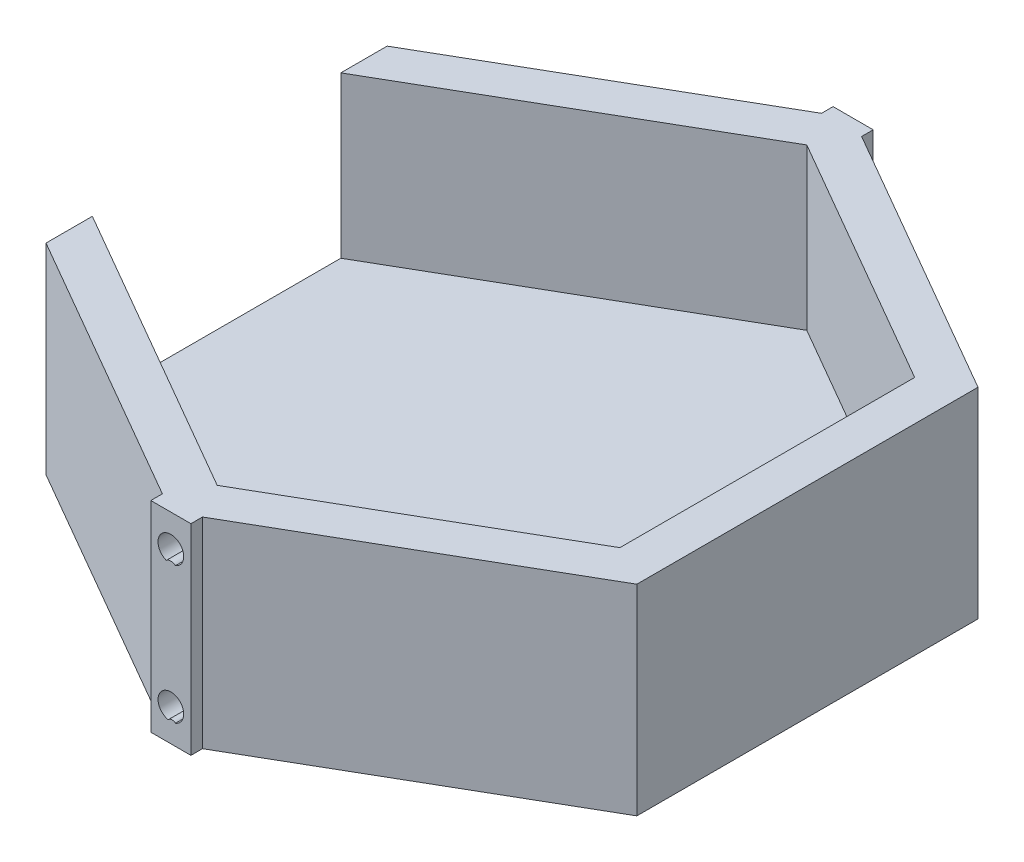
ISO-10303-21;
HEADER;
FILE_DESCRIPTION(('STEP AP214'),'2;1');
FILE_NAME('part.step','',(''),(''),'','','');
FILE_SCHEMA(('AUTOMOTIVE_DESIGN { 1 0 10303 214 1 1 1 1 }'));
ENDSEC;
DATA;
#1=APPLICATION_CONTEXT('core data for automotive mechanical design processes');
#2=APPLICATION_PROTOCOL_DEFINITION('international standard','automotive_design',2000,#1);
#3=PRODUCT_CONTEXT('',#1,'mechanical');
#4=PRODUCT('Part','Part','',(#3));
#5=PRODUCT_RELATED_PRODUCT_CATEGORY('part','',(#4));
#6=PRODUCT_DEFINITION_FORMATION('','',#4);
#7=PRODUCT_DEFINITION_CONTEXT('part definition',#1,'design');
#8=PRODUCT_DEFINITION('design','',#6,#7);
#9=PRODUCT_DEFINITION_SHAPE('','',#8);
#10=(LENGTH_UNIT() NAMED_UNIT(*) SI_UNIT(.MILLI.,.METRE.));
#11=(NAMED_UNIT(*) PLANE_ANGLE_UNIT() SI_UNIT($,.RADIAN.));
#12=(NAMED_UNIT(*) SI_UNIT($,.STERADIAN.) SOLID_ANGLE_UNIT());
#13=UNCERTAINTY_MEASURE_WITH_UNIT(LENGTH_MEASURE(1.E-05),#10,'distance_accuracy_value','');
#14=(GEOMETRIC_REPRESENTATION_CONTEXT(3) GLOBAL_UNCERTAINTY_ASSIGNED_CONTEXT((#13)) GLOBAL_UNIT_ASSIGNED_CONTEXT((#10,
#11,#12)) REPRESENTATION_CONTEXT('',''));
#15=CARTESIAN_POINT('',(0.,0.,0.));
#16=DIRECTION('',(0.,0.,1.));
#17=DIRECTION('',(1.,0.,0.));
#18=AXIS2_PLACEMENT_3D('',#15,#16,#17);
#19=CARTESIAN_POINT('',(0.,0.,42.5));
#20=DIRECTION('',(0.,0.,-1.));
#21=DIRECTION('',(1.,0.,0.));
#22=AXIS2_PLACEMENT_3D('',#19,#20,#21);
#23=PLANE('',#22);
#24=CARTESIAN_POINT('',(0.,21.,42.5));
#25=DIRECTION('',(0.,0.,-1.));
#26=DIRECTION('',(-1.,0.,0.));
#27=AXIS2_PLACEMENT_3D('',#24,#25,#26);
#28=CIRCLE('',#27,1.6);
#29=CARTESIAN_POINT('',(-0.573600046043133,19.5063524555039,42.5));
#30=VERTEX_POINT('',#29);
#31=CARTESIAN_POINT('',(0.573600046043132,19.5063524555039,42.5));
#32=VERTEX_POINT('',#31);
#33=EDGE_CURVE('E61',#30,#32,#28,.T.);
#34=ORIENTED_EDGE('',*,*,#33,.T.);
#35=CARTESIAN_POINT('',(0.,18.8205118585709,42.5));
#36=DIRECTION('',(0.,0.,-1.));
#37=DIRECTION('',(-1.,0.,0.));
#38=AXIS2_PLACEMENT_3D('',#35,#36,#37);
#39=CIRCLE('',#38,0.894088551107802);
#40=EDGE_CURVE('E237',#32,#30,#39,.F.);
#41=ORIENTED_EDGE('',*,*,#40,.T.);
#42=EDGE_LOOP('',(#34,#41));
#43=FACE_BOUND('',#42,.T.);
#44=DIRECTION('',(-1.,0.,0.));
#45=VECTOR('',#44,1.);
#46=CARTESIAN_POINT('',(2.5,25.,42.5));
#47=LINE('',#46,#45);
#48=CARTESIAN_POINT('',(2.5,25.,42.5));
#49=VERTEX_POINT('',#48);
#50=CARTESIAN_POINT('',(-2.5,25.,42.5));
#51=VERTEX_POINT('',#50);
#52=EDGE_CURVE('E269',#49,#51,#47,.T.);
#53=ORIENTED_EDGE('',*,*,#52,.T.);
#54=DIRECTION('',(0.,-1.,0.));
#55=VECTOR('',#54,1.);
#56=CARTESIAN_POINT('',(-2.5,0.,42.5));
#57=LINE('',#56,#55);
#58=CARTESIAN_POINT('',(-2.5,0.,42.5));
#59=VERTEX_POINT('',#58);
#60=EDGE_CURVE('E246',#51,#59,#57,.T.);
#61=ORIENTED_EDGE('',*,*,#60,.T.);
#62=DIRECTION('',(1.,0.,0.));
#63=VECTOR('',#62,1.);
#64=CARTESIAN_POINT('',(2.5,0.,42.5));
#65=LINE('',#64,#63);
#66=CARTESIAN_POINT('',(2.5,0.,42.5));
#67=VERTEX_POINT('',#66);
#68=EDGE_CURVE('E276',#59,#67,#65,.T.);
#69=ORIENTED_EDGE('',*,*,#68,.T.);
#70=DIRECTION('',(0.,1.,0.));
#71=VECTOR('',#70,1.);
#72=CARTESIAN_POINT('',(2.5,0.,42.5));
#73=LINE('',#72,#71);
#74=EDGE_CURVE('E272',#67,#49,#73,.T.);
#75=ORIENTED_EDGE('',*,*,#74,.T.);
#76=EDGE_LOOP('',(#53,#61,#69,#75));
#77=FACE_BOUND('',#76,.T.);
#78=CARTESIAN_POINT('',(0.,4.,42.5));
#79=DIRECTION('',(0.,0.,-1.));
#80=DIRECTION('',(-1.,0.,0.));
#81=AXIS2_PLACEMENT_3D('',#78,#79,#80);
#82=CIRCLE('',#81,1.6);
#83=CARTESIAN_POINT('',(-0.329089606583653,2.43420945499131,42.5));
#84=VERTEX_POINT('',#83);
#85=CARTESIAN_POINT('',(0.573600046043129,2.50635245550387,42.5));
#86=VERTEX_POINT('',#85);
#87=EDGE_CURVE('E253',#84,#86,#82,.T.);
#88=ORIENTED_EDGE('',*,*,#87,.T.);
#89=CARTESIAN_POINT('',(0.158326719986019,2.0189361289342,42.5));
#90=DIRECTION('',(0.,0.,-1.));
#91=DIRECTION('',(-1.,0.,0.));
#92=AXIS2_PLACEMENT_3D('',#89,#90,#91);
#93=CIRCLE('',#92,0.640333202903933);
#94=EDGE_CURVE('E69',#84,#86,#93,.T.);
#95=ORIENTED_EDGE('',*,*,#94,.F.);
#96=EDGE_LOOP('',(#88,#95));
#97=FACE_BOUND('',#96,.T.);
#98=ADVANCED_FACE('F45',(#43,#77,#97),#23,.F.);
#99=CARTESIAN_POINT('',(0.,0.,-42.5));
#100=DIRECTION('',(0.,0.,1.));
#101=DIRECTION('',(1.,0.,0.));
#102=AXIS2_PLACEMENT_3D('',#99,#100,#101);
#103=PLANE('',#102);
#104=CARTESIAN_POINT('',(0.,18.8205118585709,-42.5));
#105=DIRECTION('',(0.,0.,-1.));
#106=DIRECTION('',(-1.,0.,0.));
#107=AXIS2_PLACEMENT_3D('',#104,#105,#106);
#108=CIRCLE('',#107,0.894088551107802);
#109=CARTESIAN_POINT('',(0.57360004604313,19.5063524555039,-42.5));
#110=VERTEX_POINT('',#109);
#111=CARTESIAN_POINT('',(-0.573600046043133,19.5063524555039,-42.5));
#112=VERTEX_POINT('',#111);
#113=EDGE_CURVE('E307',#110,#112,#108,.F.);
#114=ORIENTED_EDGE('',*,*,#113,.F.);
#115=CARTESIAN_POINT('',(0.,21.,-42.5));
#116=DIRECTION('',(0.,0.,-1.));
#117=DIRECTION('',(-1.,0.,0.));
#118=AXIS2_PLACEMENT_3D('',#115,#116,#117);
#119=CIRCLE('',#118,1.6);
#120=EDGE_CURVE('E312',#112,#110,#119,.T.);
#121=ORIENTED_EDGE('',*,*,#120,.F.);
#122=EDGE_LOOP('',(#114,#121));
#123=FACE_BOUND('',#122,.T.);
#124=DIRECTION('',(0.,-1.,0.));
#125=VECTOR('',#124,1.);
#126=CARTESIAN_POINT('',(-2.5,0.,-42.5));
#127=LINE('',#126,#125);
#128=CARTESIAN_POINT('',(-2.5,25.,-42.5));
#129=VERTEX_POINT('',#128);
#130=CARTESIAN_POINT('',(-2.5,0.,-42.5));
#131=VERTEX_POINT('',#130);
#132=EDGE_CURVE('E322',#129,#131,#127,.T.);
#133=ORIENTED_EDGE('',*,*,#132,.F.);
#134=DIRECTION('',(-1.,0.,0.));
#135=VECTOR('',#134,1.);
#136=CARTESIAN_POINT('',(2.5,25.,-42.5));
#137=LINE('',#136,#135);
#138=CARTESIAN_POINT('',(2.5,25.,-42.5));
#139=VERTEX_POINT('',#138);
#140=EDGE_CURVE('E357',#139,#129,#137,.T.);
#141=ORIENTED_EDGE('',*,*,#140,.F.);
#142=DIRECTION('',(0.,1.,0.));
#143=VECTOR('',#142,1.);
#144=CARTESIAN_POINT('',(2.5,0.,-42.5));
#145=LINE('',#144,#143);
#146=CARTESIAN_POINT('',(2.5,0.,-42.5));
#147=VERTEX_POINT('',#146);
#148=EDGE_CURVE('E353',#147,#139,#145,.T.);
#149=ORIENTED_EDGE('',*,*,#148,.F.);
#150=DIRECTION('',(1.,0.,0.));
#151=VECTOR('',#150,1.);
#152=CARTESIAN_POINT('',(2.5,0.,-42.5));
#153=LINE('',#152,#151);
#154=EDGE_CURVE('E349',#131,#147,#153,.T.);
#155=ORIENTED_EDGE('',*,*,#154,.F.);
#156=EDGE_LOOP('',(#133,#141,#149,#155));
#157=FACE_BOUND('',#156,.T.);
#158=CARTESIAN_POINT('',(0.158326719986019,2.0189361289342,-42.5));
#159=DIRECTION('',(0.,0.,-1.));
#160=DIRECTION('',(-1.,0.,0.));
#161=AXIS2_PLACEMENT_3D('',#158,#159,#160);
#162=CIRCLE('',#161,0.640333202903933);
#163=CARTESIAN_POINT('',(-0.329089606583653,2.43420945499131,-42.5));
#164=VERTEX_POINT('',#163);
#165=CARTESIAN_POINT('',(0.573600046043129,2.50635245550387,-42.5));
#166=VERTEX_POINT('',#165);
#167=EDGE_CURVE('E301',#164,#166,#162,.T.);
#168=ORIENTED_EDGE('',*,*,#167,.T.);
#169=CARTESIAN_POINT('',(0.,4.,-42.5));
#170=DIRECTION('',(0.,0.,-1.));
#171=DIRECTION('',(-1.,0.,0.));
#172=AXIS2_PLACEMENT_3D('',#169,#170,#171);
#173=CIRCLE('',#172,1.6);
#174=EDGE_CURVE('E330',#164,#166,#173,.T.);
#175=ORIENTED_EDGE('',*,*,#174,.F.);
#176=EDGE_LOOP('',(#168,#175));
#177=FACE_BOUND('',#176,.T.);
#178=ADVANCED_FACE('F546',(#123,#157,#177),#103,.F.);
#179=CARTESIAN_POINT('',(36.8060796608386,25.,-21.25));
#180=DIRECTION('',(-0.5,0.,0.866025403784439));
#181=DIRECTION('',(0.866025403784439,0.,0.5));
#182=AXIS2_PLACEMENT_3D('',#179,#180,#181);
#183=PLANE('',#182);
#184=DIRECTION('',(0.,-1.,0.));
#185=VECTOR('',#184,1.);
#186=CARTESIAN_POINT('',(2.5,25.,-41.0566243270259));
#187=LINE('',#186,#185);
#188=CARTESIAN_POINT('',(2.5,25.,-41.056624327026));
#189=VERTEX_POINT('',#188);
#190=CARTESIAN_POINT('',(2.5,0.,-41.056624327026));
#191=VERTEX_POINT('',#190);
#192=EDGE_CURVE('E374',#189,#191,#187,.T.);
#193=ORIENTED_EDGE('',*,*,#192,.F.);
#194=DIRECTION('',(-0.866025403784439,0.,-0.5));
#195=VECTOR('',#194,1.);
#196=CARTESIAN_POINT('',(36.8060796608386,25.,-21.25));
#197=LINE('',#196,#195);
#198=CARTESIAN_POINT('',(36.8060796608386,25.,-21.25));
#199=VERTEX_POINT('',#198);
#200=EDGE_CURVE('E441',#199,#189,#197,.T.);
#201=ORIENTED_EDGE('',*,*,#200,.F.);
#202=DIRECTION('',(0.,-1.,0.));
#203=VECTOR('',#202,1.);
#204=CARTESIAN_POINT('',(36.8060796608386,25.,-21.25));
#205=LINE('',#204,#203);
#206=CARTESIAN_POINT('',(36.8060796608386,0.,-21.25));
#207=VERTEX_POINT('',#206);
#208=EDGE_CURVE('E464',#199,#207,#205,.T.);
#209=ORIENTED_EDGE('',*,*,#208,.T.);
#210=DIRECTION('',(-0.866025403784439,0.,-0.5));
#211=VECTOR('',#210,1.);
#212=CARTESIAN_POINT('',(36.8060796608386,0.,-21.25));
#213=LINE('',#212,#211);
#214=EDGE_CURVE('E390',#207,#191,#213,.T.);
#215=ORIENTED_EDGE('',*,*,#214,.T.);
#216=EDGE_LOOP('',(#193,#201,#209,#215));
#217=FACE_BOUND('',#216,.T.);
#218=ADVANCED_FACE('F47',(#217),#183,.F.);
#219=CARTESIAN_POINT('',(0.,25.,-42.5));
#220=DIRECTION('',(0.5,0.,0.866025403784439));
#221=DIRECTION('',(0.866025403784439,0.,-0.5));
#222=AXIS2_PLACEMENT_3D('',#219,#220,#221);
#223=PLANE('',#222);
#224=DIRECTION('',(0.,1.,0.));
#225=VECTOR('',#224,1.);
#226=CARTESIAN_POINT('',(-2.5,25.,-41.056624327026));
#227=LINE('',#226,#225);
#228=CARTESIAN_POINT('',(-2.5,0.,-41.056624327026));
#229=VERTEX_POINT('',#228);
#230=CARTESIAN_POINT('',(-2.5,25.,-41.056624327026));
#231=VERTEX_POINT('',#230);
#232=EDGE_CURVE('E377',#229,#231,#227,.T.);
#233=ORIENTED_EDGE('',*,*,#232,.F.);
#234=DIRECTION('',(-0.866025403784439,0.,0.5));
#235=VECTOR('',#234,1.);
#236=CARTESIAN_POINT('',(0.,0.,-42.5));
#237=LINE('',#236,#235);
#238=CARTESIAN_POINT('',(-36.8060796608386,0.,-21.25));
#239=VERTEX_POINT('',#238);
#240=EDGE_CURVE('E468',#229,#239,#237,.T.);
#241=ORIENTED_EDGE('',*,*,#240,.T.);
#242=DIRECTION('',(0.,-1.,0.));
#243=VECTOR('',#242,1.);
#244=CARTESIAN_POINT('',(-36.8060796608386,25.,-21.25));
#245=LINE('',#244,#243);
#246=CARTESIAN_POINT('',(-36.8060796608386,25.,-21.25));
#247=VERTEX_POINT('',#246);
#248=EDGE_CURVE('E11',#247,#239,#245,.T.);
#249=ORIENTED_EDGE('',*,*,#248,.F.);
#250=DIRECTION('',(-0.866025403784439,0.,0.5));
#251=VECTOR('',#250,1.);
#252=CARTESIAN_POINT('',(0.,25.,-42.5));
#253=LINE('',#252,#251);
#254=EDGE_CURVE('E445',#231,#247,#253,.T.);
#255=ORIENTED_EDGE('',*,*,#254,.F.);
#256=EDGE_LOOP('',(#233,#241,#249,#255));
#257=FACE_BOUND('',#256,.T.);
#258=ADVANCED_FACE('F538',(#257),#223,.F.);
#259=CARTESIAN_POINT('',(-36.8060796608386,25.,-21.25));
#260=DIRECTION('',(1.,0.,0.));
#261=DIRECTION('',(0.,0.,-1.));
#262=AXIS2_PLACEMENT_3D('',#259,#260,#261);
#263=PLANE('',#262);
#264=DIRECTION('',(0.,0.,1.));
#265=VECTOR('',#264,1.);
#266=CARTESIAN_POINT('',(-36.8060796608386,25.,-21.25));
#267=LINE('',#266,#265);
#268=CARTESIAN_POINT('',(-36.8060796608386,25.,15.4764973081037));
#269=VERTEX_POINT('',#268);
#270=CARTESIAN_POINT('',(-36.8060796608386,25.,21.25));
#271=VERTEX_POINT('',#270);
#272=EDGE_CURVE('E449',#269,#271,#267,.T.);
#273=ORIENTED_EDGE('',*,*,#272,.F.);
#274=DIRECTION('',(0.,-1.,0.));
#275=VECTOR('',#274,1.);
#276=CARTESIAN_POINT('',(-36.8060796608386,25.,15.4764973081037));
#277=LINE('',#276,#275);
#278=CARTESIAN_POINT('',(-36.8060796608386,5.,15.4764973081037));
#279=VERTEX_POINT('',#278);
#280=EDGE_CURVE('E415',#269,#279,#277,.T.);
#281=ORIENTED_EDGE('',*,*,#280,.T.);
#282=DIRECTION('',(0.,0.,1.));
#283=VECTOR('',#282,1.);
#284=CARTESIAN_POINT('',(-36.8060796608386,5.,-21.25));
#285=LINE('',#284,#283);
#286=CARTESIAN_POINT('',(-36.8060796608386,5.,-15.4764973081038));
#287=VERTEX_POINT('',#286);
#288=EDGE_CURVE('E400',#287,#279,#285,.T.);
#289=ORIENTED_EDGE('',*,*,#288,.F.);
#290=DIRECTION('',(0.,-1.,0.));
#291=VECTOR('',#290,1.);
#292=CARTESIAN_POINT('',(-36.8060796608386,25.,-15.4764973081038));
#293=LINE('',#292,#291);
#294=CARTESIAN_POINT('',(-36.8060796608386,25.,-15.4764973081038));
#295=VERTEX_POINT('',#294);
#296=EDGE_CURVE('E391',#295,#287,#293,.T.);
#297=ORIENTED_EDGE('',*,*,#296,.F.);
#298=EDGE_CURVE('E450',#247,#295,#267,.T.);
#299=ORIENTED_EDGE('',*,*,#298,.F.);
#300=ORIENTED_EDGE('',*,*,#248,.T.);
#301=DIRECTION('',(0.,0.,1.));
#302=VECTOR('',#301,1.);
#303=CARTESIAN_POINT('',(-36.8060796608386,0.,-21.25));
#304=LINE('',#303,#302);
#305=CARTESIAN_POINT('',(-36.8060796608386,0.,21.25));
#306=VERTEX_POINT('',#305);
#307=EDGE_CURVE('E471',#239,#306,#304,.T.);
#308=ORIENTED_EDGE('',*,*,#307,.T.);
#309=DIRECTION('',(0.,-1.,0.));
#310=VECTOR('',#309,1.);
#311=CARTESIAN_POINT('',(-36.8060796608386,25.,21.25));
#312=LINE('',#311,#310);
#313=EDGE_CURVE('E54',#271,#306,#312,.T.);
#314=ORIENTED_EDGE('',*,*,#313,.F.);
#315=EDGE_LOOP('',(#273,#281,#289,#297,#299,#300,#308,#314));
#316=FACE_BOUND('',#315,.T.);
#317=ADVANCED_FACE('F517',(#316),#263,.F.);
#318=CARTESIAN_POINT('',(-36.8060796608386,25.,21.25));
#319=DIRECTION('',(0.5,0.,-0.866025403784439));
#320=DIRECTION('',(-0.866025403784439,0.,-0.5));
#321=AXIS2_PLACEMENT_3D('',#318,#319,#320);
#322=PLANE('',#321);
#323=DIRECTION('',(0.866025403784439,0.,0.5));
#324=VECTOR('',#323,1.);
#325=CARTESIAN_POINT('',(-36.8060796608386,0.,21.25));
#326=LINE('',#325,#324);
#327=CARTESIAN_POINT('',(-2.5,0.,41.0566243270259));
#328=VERTEX_POINT('',#327);
#329=EDGE_CURVE('E474',#306,#328,#326,.T.);
#330=ORIENTED_EDGE('',*,*,#329,.T.);
#331=DIRECTION('',(0.,1.,0.));
#332=VECTOR('',#331,1.);
#333=CARTESIAN_POINT('',(-2.5,25.,41.0566243270259));
#334=LINE('',#333,#332);
#335=CARTESIAN_POINT('',(-2.5,25.,41.0566243270259));
#336=VERTEX_POINT('',#335);
#337=EDGE_CURVE('E298',#328,#336,#334,.T.);
#338=ORIENTED_EDGE('',*,*,#337,.T.);
#339=DIRECTION('',(0.866025403784439,0.,0.5));
#340=VECTOR('',#339,1.);
#341=CARTESIAN_POINT('',(-36.8060796608386,25.,21.25));
#342=LINE('',#341,#340);
#343=EDGE_CURVE('E454',#271,#336,#342,.T.);
#344=ORIENTED_EDGE('',*,*,#343,.F.);
#345=ORIENTED_EDGE('',*,*,#313,.T.);
#346=EDGE_LOOP('',(#330,#338,#344,#345));
#347=FACE_BOUND('',#346,.T.);
#348=ADVANCED_FACE('F494',(#347),#322,.F.);
#349=CARTESIAN_POINT('',(0.,25.,42.5));
#350=DIRECTION('',(-0.5,0.,-0.866025403784439));
#351=DIRECTION('',(-0.866025403784439,0.,0.5));
#352=AXIS2_PLACEMENT_3D('',#349,#350,#351);
#353=PLANE('',#352);
#354=DIRECTION('',(0.866025403784439,0.,-0.5));
#355=VECTOR('',#354,1.);
#356=CARTESIAN_POINT('',(0.,25.,42.5));
#357=LINE('',#356,#355);
#358=CARTESIAN_POINT('',(2.5,25.,41.0566243270259));
#359=VERTEX_POINT('',#358);
#360=CARTESIAN_POINT('',(36.8060796608386,25.,21.25));
#361=VERTEX_POINT('',#360);
#362=EDGE_CURVE('E458',#359,#361,#357,.T.);
#363=ORIENTED_EDGE('',*,*,#362,.F.);
#364=DIRECTION('',(0.,-1.,0.));
#365=VECTOR('',#364,1.);
#366=CARTESIAN_POINT('',(2.5,25.,41.0566243270259));
#367=LINE('',#366,#365);
#368=CARTESIAN_POINT('',(2.5,0.,41.0566243270259));
#369=VERTEX_POINT('',#368);
#370=EDGE_CURVE('E294',#359,#369,#367,.T.);
#371=ORIENTED_EDGE('',*,*,#370,.T.);
#372=DIRECTION('',(0.866025403784439,0.,-0.5));
#373=VECTOR('',#372,1.);
#374=CARTESIAN_POINT('',(0.,0.,42.5));
#375=LINE('',#374,#373);
#376=CARTESIAN_POINT('',(36.8060796608386,0.,21.25));
#377=VERTEX_POINT('',#376);
#378=EDGE_CURVE('E477',#369,#377,#375,.T.);
#379=ORIENTED_EDGE('',*,*,#378,.T.);
#380=DIRECTION('',(0.,-1.,0.));
#381=VECTOR('',#380,1.);
#382=CARTESIAN_POINT('',(36.8060796608386,25.,21.25));
#383=LINE('',#382,#381);
#384=EDGE_CURVE('E485',#361,#377,#383,.T.);
#385=ORIENTED_EDGE('',*,*,#384,.F.);
#386=EDGE_LOOP('',(#363,#371,#379,#385));
#387=FACE_BOUND('',#386,.T.);
#388=ADVANCED_FACE('F563',(#387),#353,.F.);
#389=CARTESIAN_POINT('',(36.8060796608386,25.,21.25));
#390=DIRECTION('',(-1.,0.,0.));
#391=DIRECTION('',(0.,0.,1.));
#392=AXIS2_PLACEMENT_3D('',#389,#390,#391);
#393=PLANE('',#392);
#394=DIRECTION('',(0.,0.,-1.));
#395=VECTOR('',#394,1.);
#396=CARTESIAN_POINT('',(36.8060796608386,0.,21.25));
#397=LINE('',#396,#395);
#398=EDGE_CURVE('E446',#377,#207,#397,.T.);
#399=ORIENTED_EDGE('',*,*,#398,.T.);
#400=ORIENTED_EDGE('',*,*,#208,.F.);
#401=DIRECTION('',(0.,0.,-1.));
#402=VECTOR('',#401,1.);
#403=CARTESIAN_POINT('',(36.8060796608386,25.,21.25));
#404=LINE('',#403,#402);
#405=EDGE_CURVE('E461',#361,#199,#404,.T.);
#406=ORIENTED_EDGE('',*,*,#405,.F.);
#407=ORIENTED_EDGE('',*,*,#384,.T.);
#408=EDGE_LOOP('',(#399,#400,#406,#407));
#409=FACE_BOUND('',#408,.T.);
#410=ADVANCED_FACE('F558',(#409),#393,.F.);
#411=CARTESIAN_POINT('',(0.,25.,0.));
#412=DIRECTION('',(0.,1.,0.));
#413=DIRECTION('',(0.,0.,1.));
#414=AXIS2_PLACEMENT_3D('',#411,#412,#413);
#415=PLANE('',#414);
#416=ORIENTED_EDGE('',*,*,#343,.T.);
#417=DIRECTION('',(0.,0.,1.));
#418=VECTOR('',#417,1.);
#419=CARTESIAN_POINT('',(-2.5,25.,37.5));
#420=LINE('',#419,#418);
#421=EDGE_CURVE('E290',#336,#51,#420,.T.);
#422=ORIENTED_EDGE('',*,*,#421,.T.);
#423=ORIENTED_EDGE('',*,*,#52,.F.);
#424=DIRECTION('',(0.,0.,1.));
#425=VECTOR('',#424,1.);
#426=CARTESIAN_POINT('',(2.5,25.,37.5));
#427=LINE('',#426,#425);
#428=EDGE_CURVE('E287',#359,#49,#427,.T.);
#429=ORIENTED_EDGE('',*,*,#428,.F.);
#430=ORIENTED_EDGE('',*,*,#362,.T.);
#431=ORIENTED_EDGE('',*,*,#405,.T.);
#432=ORIENTED_EDGE('',*,*,#200,.T.);
#433=DIRECTION('',(0.,0.,-1.));
#434=VECTOR('',#433,1.);
#435=CARTESIAN_POINT('',(2.5,25.,-37.5));
#436=LINE('',#435,#434);
#437=EDGE_CURVE('E364',#189,#139,#436,.T.);
#438=ORIENTED_EDGE('',*,*,#437,.T.);
#439=ORIENTED_EDGE('',*,*,#140,.T.);
#440=DIRECTION('',(0.,0.,-1.));
#441=VECTOR('',#440,1.);
#442=CARTESIAN_POINT('',(-2.5,25.,-37.5));
#443=LINE('',#442,#441);
#444=EDGE_CURVE('E360',#231,#129,#443,.T.);
#445=ORIENTED_EDGE('',*,*,#444,.F.);
#446=ORIENTED_EDGE('',*,*,#254,.T.);
#447=ORIENTED_EDGE('',*,*,#298,.T.);
#448=DIRECTION('',(-0.866025403784439,0.,0.5));
#449=VECTOR('',#448,1.);
#450=CARTESIAN_POINT('',(2.5,25.,-38.1698729810778));
#451=LINE('',#450,#449);
#452=CARTESIAN_POINT('',(0.,25.,-36.7264973081038));
#453=VERTEX_POINT('',#452);
#454=EDGE_CURVE('E421',#453,#295,#451,.T.);
#455=ORIENTED_EDGE('',*,*,#454,.F.);
#456=DIRECTION('',(-0.866025403784439,0.,-0.5));
#457=VECTOR('',#456,1.);
#458=CARTESIAN_POINT('',(34.3060796608386,25.,-16.9198729810778));
#459=LINE('',#458,#457);
#460=CARTESIAN_POINT('',(31.8060796608386,25.,-18.3632486540519));
#461=VERTEX_POINT('',#460);
#462=EDGE_CURVE('E404',#461,#453,#459,.T.);
#463=ORIENTED_EDGE('',*,*,#462,.F.);
#464=DIRECTION('',(0.,0.,-1.));
#465=VECTOR('',#464,1.);
#466=CARTESIAN_POINT('',(31.8060796608386,25.,21.25));
#467=LINE('',#466,#465);
#468=CARTESIAN_POINT('',(31.8060796608386,25.,18.3632486540519));
#469=VERTEX_POINT('',#468);
#470=EDGE_CURVE('E397',#469,#461,#467,.T.);
#471=ORIENTED_EDGE('',*,*,#470,.F.);
#472=DIRECTION('',(0.866025403784439,0.,-0.5));
#473=VECTOR('',#472,1.);
#474=CARTESIAN_POINT('',(-2.50000000000001,25.,38.1698729810778));
#475=LINE('',#474,#473);
#476=CARTESIAN_POINT('',(0.,25.,36.7264973081037));
#477=VERTEX_POINT('',#476);
#478=EDGE_CURVE('E435',#477,#469,#475,.T.);
#479=ORIENTED_EDGE('',*,*,#478,.F.);
#480=DIRECTION('',(0.866025403784439,0.,0.5));
#481=VECTOR('',#480,1.);
#482=CARTESIAN_POINT('',(-34.3060796608386,25.,16.9198729810778));
#483=LINE('',#482,#481);
#484=EDGE_CURVE('E424',#269,#477,#483,.T.);
#485=ORIENTED_EDGE('',*,*,#484,.F.);
#486=ORIENTED_EDGE('',*,*,#272,.T.);
#487=EDGE_LOOP('',(#416,#422,#423,#429,#430,#431,#432,#438,#439,#445,#446,#447,#455,#463,#471,
#479,#485,#486));
#488=FACE_BOUND('',#487,.T.);
#489=ADVANCED_FACE('F513',(#488),#415,.T.);
#490=CARTESIAN_POINT('',(0.,0.,0.));
#491=DIRECTION('',(0.,1.,0.));
#492=DIRECTION('',(0.,0.,1.));
#493=AXIS2_PLACEMENT_3D('',#490,#491,#492);
#494=PLANE('',#493);
#495=ORIENTED_EDGE('',*,*,#68,.F.);
#496=DIRECTION('',(0.,0.,1.));
#497=VECTOR('',#496,1.);
#498=CARTESIAN_POINT('',(-2.5,0.,37.5));
#499=LINE('',#498,#497);
#500=EDGE_CURVE('E280',#328,#59,#499,.T.);
#501=ORIENTED_EDGE('',*,*,#500,.F.);
#502=ORIENTED_EDGE('',*,*,#329,.F.);
#503=ORIENTED_EDGE('',*,*,#307,.F.);
#504=ORIENTED_EDGE('',*,*,#240,.F.);
#505=DIRECTION('',(0.,0.,-1.));
#506=VECTOR('',#505,1.);
#507=CARTESIAN_POINT('',(-2.5,0.,-37.5));
#508=LINE('',#507,#506);
#509=EDGE_CURVE('E370',#229,#131,#508,.T.);
#510=ORIENTED_EDGE('',*,*,#509,.T.);
#511=ORIENTED_EDGE('',*,*,#154,.T.);
#512=DIRECTION('',(0.,0.,-1.));
#513=VECTOR('',#512,1.);
#514=CARTESIAN_POINT('',(2.5,0.,-37.5));
#515=LINE('',#514,#513);
#516=EDGE_CURVE('E367',#191,#147,#515,.T.);
#517=ORIENTED_EDGE('',*,*,#516,.F.);
#518=ORIENTED_EDGE('',*,*,#214,.F.);
#519=ORIENTED_EDGE('',*,*,#398,.F.);
#520=ORIENTED_EDGE('',*,*,#378,.F.);
#521=DIRECTION('',(0.,0.,1.));
#522=VECTOR('',#521,1.);
#523=CARTESIAN_POINT('',(2.5,0.,37.5));
#524=LINE('',#523,#522);
#525=EDGE_CURVE('E284',#369,#67,#524,.T.);
#526=ORIENTED_EDGE('',*,*,#525,.T.);
#527=EDGE_LOOP('',(#495,#501,#502,#503,#504,#510,#511,#517,#518,#519,#520,#526));
#528=FACE_BOUND('',#527,.T.);
#529=ADVANCED_FACE('F501',(#528),#494,.F.);
#530=CARTESIAN_POINT('',(34.3060796608386,25.,-16.9198729810778));
#531=DIRECTION('',(-0.5,0.,0.866025403784439));
#532=DIRECTION('',(0.866025403784439,0.,0.5));
#533=AXIS2_PLACEMENT_3D('',#530,#531,#532);
#534=PLANE('',#533);
#535=DIRECTION('',(-0.866025403784439,0.,-0.5));
#536=VECTOR('',#535,1.);
#537=CARTESIAN_POINT('',(34.3060796608386,5.,-16.9198729810778));
#538=LINE('',#537,#536);
#539=CARTESIAN_POINT('',(31.8060796608386,5.,-18.3632486540519));
#540=VERTEX_POINT('',#539);
#541=CARTESIAN_POINT('',(0.,5.,-36.7264973081038));
#542=VERTEX_POINT('',#541);
#543=EDGE_CURVE('E381',#540,#542,#538,.T.);
#544=ORIENTED_EDGE('',*,*,#543,.F.);
#545=DIRECTION('',(0.,-1.,0.));
#546=VECTOR('',#545,1.);
#547=CARTESIAN_POINT('',(31.8060796608386,25.,-18.3632486540519));
#548=LINE('',#547,#546);
#549=EDGE_CURVE('E392',#461,#540,#548,.T.);
#550=ORIENTED_EDGE('',*,*,#549,.F.);
#551=ORIENTED_EDGE('',*,*,#462,.T.);
#552=DIRECTION('',(0.,-1.,0.));
#553=VECTOR('',#552,1.);
#554=CARTESIAN_POINT('',(0.,25.,-36.7264973081038));
#555=LINE('',#554,#553);
#556=EDGE_CURVE('E386',#453,#542,#555,.T.);
#557=ORIENTED_EDGE('',*,*,#556,.T.);
#558=EDGE_LOOP('',(#544,#550,#551,#557));
#559=FACE_BOUND('',#558,.T.);
#560=ADVANCED_FACE('F641',(#559),#534,.T.);
#561=CARTESIAN_POINT('',(2.5,25.,-38.1698729810778));
#562=DIRECTION('',(0.5,0.,0.866025403784439));
#563=DIRECTION('',(0.866025403784439,0.,-0.5));
#564=AXIS2_PLACEMENT_3D('',#561,#562,#563);
#565=PLANE('',#564);
#566=DIRECTION('',(-0.866025403784439,0.,0.5));
#567=VECTOR('',#566,1.);
#568=CARTESIAN_POINT('',(2.5,5.,-38.1698729810778));
#569=LINE('',#568,#567);
#570=EDGE_CURVE('E385',#542,#287,#569,.T.);
#571=ORIENTED_EDGE('',*,*,#570,.F.);
#572=ORIENTED_EDGE('',*,*,#556,.F.);
#573=ORIENTED_EDGE('',*,*,#454,.T.);
#574=ORIENTED_EDGE('',*,*,#296,.T.);
#575=EDGE_LOOP('',(#571,#572,#573,#574));
#576=FACE_BOUND('',#575,.T.);
#577=ADVANCED_FACE('F530',(#576),#565,.T.);
#578=CARTESIAN_POINT('',(-34.3060796608386,25.,16.9198729810778));
#579=DIRECTION('',(0.5,0.,-0.866025403784439));
#580=DIRECTION('',(-0.866025403784439,0.,-0.5));
#581=AXIS2_PLACEMENT_3D('',#578,#579,#580);
#582=PLANE('',#581);
#583=DIRECTION('',(0.866025403784439,0.,0.5));
#584=VECTOR('',#583,1.);
#585=CARTESIAN_POINT('',(-34.3060796608386,5.,16.9198729810778));
#586=LINE('',#585,#584);
#587=CARTESIAN_POINT('',(0.,5.,36.7264973081037));
#588=VERTEX_POINT('',#587);
#589=EDGE_CURVE('E408',#279,#588,#586,.T.);
#590=ORIENTED_EDGE('',*,*,#589,.F.);
#591=ORIENTED_EDGE('',*,*,#280,.F.);
#592=ORIENTED_EDGE('',*,*,#484,.T.);
#593=DIRECTION('',(0.,-1.,0.));
#594=VECTOR('',#593,1.);
#595=CARTESIAN_POINT('',(0.,25.,36.7264973081037));
#596=LINE('',#595,#594);
#597=EDGE_CURVE('E411',#477,#588,#596,.T.);
#598=ORIENTED_EDGE('',*,*,#597,.T.);
#599=EDGE_LOOP('',(#590,#591,#592,#598));
#600=FACE_BOUND('',#599,.T.);
#601=ADVANCED_FACE('F522',(#600),#582,.T.);
#602=CARTESIAN_POINT('',(-2.50000000000001,25.,38.1698729810778));
#603=DIRECTION('',(-0.5,0.,-0.866025403784439));
#604=DIRECTION('',(-0.866025403784439,0.,0.5));
#605=AXIS2_PLACEMENT_3D('',#602,#603,#604);
#606=PLANE('',#605);
#607=DIRECTION('',(0.866025403784439,0.,-0.5));
#608=VECTOR('',#607,1.);
#609=CARTESIAN_POINT('',(-2.50000000000001,5.,38.1698729810778));
#610=LINE('',#609,#608);
#611=CARTESIAN_POINT('',(31.8060796608386,5.,18.3632486540519));
#612=VERTEX_POINT('',#611);
#613=EDGE_CURVE('E405',#588,#612,#610,.T.);
#614=ORIENTED_EDGE('',*,*,#613,.F.);
#615=ORIENTED_EDGE('',*,*,#597,.F.);
#616=ORIENTED_EDGE('',*,*,#478,.T.);
#617=DIRECTION('',(0.,-1.,0.));
#618=VECTOR('',#617,1.);
#619=CARTESIAN_POINT('',(31.8060796608386,25.,18.3632486540519));
#620=LINE('',#619,#618);
#621=EDGE_CURVE('E396',#469,#612,#620,.T.);
#622=ORIENTED_EDGE('',*,*,#621,.T.);
#623=EDGE_LOOP('',(#614,#615,#616,#622));
#624=FACE_BOUND('',#623,.T.);
#625=ADVANCED_FACE('F749',(#624),#606,.T.);
#626=CARTESIAN_POINT('',(31.8060796608386,25.,21.25));
#627=DIRECTION('',(-1.,0.,0.));
#628=DIRECTION('',(0.,0.,1.));
#629=AXIS2_PLACEMENT_3D('',#626,#627,#628);
#630=PLANE('',#629);
#631=DIRECTION('',(0.,0.,-1.));
#632=VECTOR('',#631,1.);
#633=CARTESIAN_POINT('',(31.8060796608386,5.,21.25));
#634=LINE('',#633,#632);
#635=EDGE_CURVE('E401',#612,#540,#634,.T.);
#636=ORIENTED_EDGE('',*,*,#635,.F.);
#637=ORIENTED_EDGE('',*,*,#621,.F.);
#638=ORIENTED_EDGE('',*,*,#470,.T.);
#639=ORIENTED_EDGE('',*,*,#549,.T.);
#640=EDGE_LOOP('',(#636,#637,#638,#639));
#641=FACE_BOUND('',#640,.T.);
#642=ADVANCED_FACE('F739',(#641),#630,.T.);
#643=CARTESIAN_POINT('',(0.,5.,0.));
#644=DIRECTION('',(0.,1.,0.));
#645=DIRECTION('',(0.,0.,1.));
#646=AXIS2_PLACEMENT_3D('',#643,#644,#645);
#647=PLANE('',#646);
#648=ORIENTED_EDGE('',*,*,#543,.T.);
#649=ORIENTED_EDGE('',*,*,#570,.T.);
#650=ORIENTED_EDGE('',*,*,#288,.T.);
#651=ORIENTED_EDGE('',*,*,#589,.T.);
#652=ORIENTED_EDGE('',*,*,#613,.T.);
#653=ORIENTED_EDGE('',*,*,#635,.T.);
#654=EDGE_LOOP('',(#648,#649,#650,#651,#652,#653));
#655=FACE_BOUND('',#654,.T.);
#656=ADVANCED_FACE('F526',(#655),#647,.T.);
#657=CARTESIAN_POINT('',(-2.5,0.,-37.5));
#658=DIRECTION('',(1.,0.,0.));
#659=DIRECTION('',(0.,0.,-1.));
#660=AXIS2_PLACEMENT_3D('',#657,#658,#659);
#661=PLANE('',#660);
#662=ORIENTED_EDGE('',*,*,#509,.F.);
#663=ORIENTED_EDGE('',*,*,#232,.T.);
#664=ORIENTED_EDGE('',*,*,#444,.T.);
#665=ORIENTED_EDGE('',*,*,#132,.T.);
#666=EDGE_LOOP('',(#662,#663,#664,#665));
#667=FACE_BOUND('',#666,.T.);
#668=ADVANCED_FACE('F543',(#667),#661,.F.);
#669=CARTESIAN_POINT('',(2.5,0.,-37.5));
#670=DIRECTION('',(-1.,0.,0.));
#671=DIRECTION('',(0.,0.,1.));
#672=AXIS2_PLACEMENT_3D('',#669,#670,#671);
#673=PLANE('',#672);
#674=ORIENTED_EDGE('',*,*,#437,.F.);
#675=ORIENTED_EDGE('',*,*,#192,.T.);
#676=ORIENTED_EDGE('',*,*,#516,.T.);
#677=ORIENTED_EDGE('',*,*,#148,.T.);
#678=EDGE_LOOP('',(#674,#675,#676,#677));
#679=FACE_BOUND('',#678,.T.);
#680=ADVANCED_FACE('F549',(#679),#673,.F.);
#681=CARTESIAN_POINT('',(0.158326719986019,2.0189361289342,-38.));
#682=DIRECTION('',(0.,0.,-1.));
#683=DIRECTION('',(-1.,0.,0.));
#684=AXIS2_PLACEMENT_3D('',#681,#682,#683);
#685=CYLINDRICAL_SURFACE('',#684,0.640333202903933);
#686=ORIENTED_EDGE('',*,*,#167,.F.);
#687=DIRECTION('',(0.,0.,-1.));
#688=VECTOR('',#687,1.);
#689=CARTESIAN_POINT('',(-0.329089606583653,2.43420945499131,-38.));
#690=LINE('',#689,#688);
#691=CARTESIAN_POINT('',(-0.329089606583653,2.43420945499131,-38.));
#692=VERTEX_POINT('',#691);
#693=EDGE_CURVE('E334',#692,#164,#690,.T.);
#694=ORIENTED_EDGE('',*,*,#693,.F.);
#695=CARTESIAN_POINT('',(0.158326719986019,2.0189361289342,-38.));
#696=DIRECTION('',(0.,0.,-1.));
#697=DIRECTION('',(-1.,0.,0.));
#698=AXIS2_PLACEMENT_3D('',#695,#696,#697);
#699=CIRCLE('',#698,0.640333202903933);
#700=CARTESIAN_POINT('',(0.573600046043129,2.50635245550387,-38.));
#701=VERTEX_POINT('',#700);
#702=EDGE_CURVE('E326',#692,#701,#699,.T.);
#703=ORIENTED_EDGE('',*,*,#702,.T.);
#704=DIRECTION('',(0.,0.,-1.));
#705=VECTOR('',#704,1.);
#706=CARTESIAN_POINT('',(0.573600046043129,2.50635245550387,-38.));
#707=LINE('',#706,#705);
#708=EDGE_CURVE('E315',#701,#166,#707,.T.);
#709=ORIENTED_EDGE('',*,*,#708,.T.);
#710=EDGE_LOOP('',(#686,#694,#703,#709));
#711=FACE_BOUND('',#710,.T.);
#712=ADVANCED_FACE('F702',(#711),#685,.T.);
#713=CARTESIAN_POINT('',(0.,4.,-38.));
#714=DIRECTION('',(0.,0.,-1.));
#715=DIRECTION('',(-1.,0.,0.));
#716=AXIS2_PLACEMENT_3D('',#713,#714,#715);
#717=CYLINDRICAL_SURFACE('',#716,1.6);
#718=ORIENTED_EDGE('',*,*,#174,.T.);
#719=ORIENTED_EDGE('',*,*,#708,.F.);
#720=CARTESIAN_POINT('',(0.,4.,-38.));
#721=DIRECTION('',(0.,0.,-1.));
#722=DIRECTION('',(-1.,0.,0.));
#723=AXIS2_PLACEMENT_3D('',#720,#721,#722);
#724=CIRCLE('',#723,1.6);
#725=EDGE_CURVE('E329',#692,#701,#724,.T.);
#726=ORIENTED_EDGE('',*,*,#725,.F.);
#727=ORIENTED_EDGE('',*,*,#693,.T.);
#728=EDGE_LOOP('',(#718,#719,#726,#727));
#729=FACE_BOUND('',#728,.T.);
#730=ADVANCED_FACE('F692',(#729),#717,.F.);
#731=CARTESIAN_POINT('',(0.,0.,-38.));
#732=DIRECTION('',(0.,0.,-1.));
#733=DIRECTION('',(-1.,0.,0.));
#734=AXIS2_PLACEMENT_3D('',#731,#732,#733);
#735=PLANE('',#734);
#736=ORIENTED_EDGE('',*,*,#702,.F.);
#737=ORIENTED_EDGE('',*,*,#725,.T.);
#738=EDGE_LOOP('',(#736,#737));
#739=FACE_BOUND('',#738,.T.);
#740=ADVANCED_FACE('F682',(#739),#735,.T.);
#741=CARTESIAN_POINT('',(0.,21.,-38.));
#742=DIRECTION('',(0.,0.,-1.));
#743=DIRECTION('',(-1.,0.,0.));
#744=AXIS2_PLACEMENT_3D('',#741,#742,#743);
#745=CYLINDRICAL_SURFACE('',#744,1.6);
#746=ORIENTED_EDGE('',*,*,#120,.T.);
#747=DIRECTION('',(0.,0.,-1.));
#748=VECTOR('',#747,1.);
#749=CARTESIAN_POINT('',(0.573600046043132,19.5063524555039,-38.));
#750=LINE('',#749,#748);
#751=CARTESIAN_POINT('',(0.573600046043132,19.5063524555039,-38.));
#752=VERTEX_POINT('',#751);
#753=EDGE_CURVE('E311',#752,#110,#750,.T.);
#754=ORIENTED_EDGE('',*,*,#753,.F.);
#755=CARTESIAN_POINT('',(0.,21.,-38.));
#756=DIRECTION('',(0.,0.,-1.));
#757=DIRECTION('',(-1.,0.,0.));
#758=AXIS2_PLACEMENT_3D('',#755,#756,#757);
#759=CIRCLE('',#758,1.6);
#760=CARTESIAN_POINT('',(-0.573600046043133,19.5063524555039,-38.));
#761=VERTEX_POINT('',#760);
#762=EDGE_CURVE('E302',#761,#752,#759,.T.);
#763=ORIENTED_EDGE('',*,*,#762,.F.);
#764=DIRECTION('',(0.,0.,-1.));
#765=VECTOR('',#764,1.);
#766=CARTESIAN_POINT('',(-0.573600046043133,19.5063524555039,-38.));
#767=LINE('',#766,#765);
#768=EDGE_CURVE('E319',#761,#112,#767,.T.);
#769=ORIENTED_EDGE('',*,*,#768,.T.);
#770=EDGE_LOOP('',(#746,#754,#763,#769));
#771=FACE_BOUND('',#770,.T.);
#772=ADVANCED_FACE('F672',(#771),#745,.F.);
#773=CARTESIAN_POINT('',(0.,18.8205118585709,-38.));
#774=DIRECTION('',(0.,0.,-1.));
#775=DIRECTION('',(-1.,0.,0.));
#776=AXIS2_PLACEMENT_3D('',#773,#774,#775);
#777=CYLINDRICAL_SURFACE('',#776,0.894088551107802);
#778=ORIENTED_EDGE('',*,*,#113,.T.);
#779=ORIENTED_EDGE('',*,*,#768,.F.);
#780=CARTESIAN_POINT('',(0.,18.8205118585709,-38.));
#781=DIRECTION('',(0.,0.,-1.));
#782=DIRECTION('',(-1.,0.,0.));
#783=AXIS2_PLACEMENT_3D('',#780,#781,#782);
#784=CIRCLE('',#783,0.894088551107802);
#785=EDGE_CURVE('E306',#752,#761,#784,.F.);
#786=ORIENTED_EDGE('',*,*,#785,.F.);
#787=ORIENTED_EDGE('',*,*,#753,.T.);
#788=EDGE_LOOP('',(#778,#779,#786,#787));
#789=FACE_BOUND('',#788,.T.);
#790=ADVANCED_FACE('F662',(#789),#777,.T.);
#791=CARTESIAN_POINT('',(0.,0.,-38.));
#792=DIRECTION('',(0.,0.,-1.));
#793=DIRECTION('',(-1.,0.,0.));
#794=AXIS2_PLACEMENT_3D('',#791,#792,#793);
#795=PLANE('',#794);
#796=ORIENTED_EDGE('',*,*,#762,.T.);
#797=ORIENTED_EDGE('',*,*,#785,.T.);
#798=EDGE_LOOP('',(#796,#797));
#799=FACE_BOUND('',#798,.T.);
#800=ADVANCED_FACE('F575',(#799),#795,.T.);
#801=CARTESIAN_POINT('',(-2.5,0.,37.5));
#802=DIRECTION('',(-1.,0.,0.));
#803=DIRECTION('',(0.,0.,1.));
#804=AXIS2_PLACEMENT_3D('',#801,#802,#803);
#805=PLANE('',#804);
#806=ORIENTED_EDGE('',*,*,#337,.F.);
#807=ORIENTED_EDGE('',*,*,#500,.T.);
#808=ORIENTED_EDGE('',*,*,#60,.F.);
#809=ORIENTED_EDGE('',*,*,#421,.F.);
#810=EDGE_LOOP('',(#806,#807,#808,#809));
#811=FACE_BOUND('',#810,.T.);
#812=ADVANCED_FACE('F505',(#811),#805,.T.);
#813=CARTESIAN_POINT('',(2.5,0.,37.5));
#814=DIRECTION('',(1.,0.,0.));
#815=DIRECTION('',(0.,0.,-1.));
#816=AXIS2_PLACEMENT_3D('',#813,#814,#815);
#817=PLANE('',#816);
#818=ORIENTED_EDGE('',*,*,#370,.F.);
#819=ORIENTED_EDGE('',*,*,#428,.T.);
#820=ORIENTED_EDGE('',*,*,#74,.F.);
#821=ORIENTED_EDGE('',*,*,#525,.F.);
#822=EDGE_LOOP('',(#818,#819,#820,#821));
#823=FACE_BOUND('',#822,.T.);
#824=ADVANCED_FACE('F565',(#823),#817,.T.);
#825=CARTESIAN_POINT('',(0.158326719986019,2.0189361289342,38.));
#826=DIRECTION('',(0.,0.,1.));
#827=DIRECTION('',(1.,0.,0.));
#828=AXIS2_PLACEMENT_3D('',#825,#826,#827);
#829=CYLINDRICAL_SURFACE('',#828,0.640333202903933);
#830=ORIENTED_EDGE('',*,*,#94,.T.);
#831=DIRECTION('',(0.,0.,1.));
#832=VECTOR('',#831,1.);
#833=CARTESIAN_POINT('',(0.573600046043129,2.50635245550387,38.));
#834=LINE('',#833,#832);
#835=CARTESIAN_POINT('',(0.573600046043129,2.50635245550387,38.));
#836=VERTEX_POINT('',#835);
#837=EDGE_CURVE('E256',#836,#86,#834,.T.);
#838=ORIENTED_EDGE('',*,*,#837,.F.);
#839=CARTESIAN_POINT('',(0.158326719986019,2.0189361289342,38.));
#840=DIRECTION('',(0.,0.,-1.));
#841=DIRECTION('',(-1.,0.,0.));
#842=AXIS2_PLACEMENT_3D('',#839,#840,#841);
#843=CIRCLE('',#842,0.640333202903933);
#844=CARTESIAN_POINT('',(-0.329089606583653,2.43420945499131,38.));
#845=VERTEX_POINT('',#844);
#846=EDGE_CURVE('E248',#845,#836,#843,.T.);
#847=ORIENTED_EDGE('',*,*,#846,.F.);
#848=DIRECTION('',(0.,0.,1.));
#849=VECTOR('',#848,1.);
#850=CARTESIAN_POINT('',(-0.329089606583653,2.43420945499131,38.));
#851=LINE('',#850,#849);
#852=EDGE_CURVE('E243',#845,#84,#851,.T.);
#853=ORIENTED_EDGE('',*,*,#852,.T.);
#854=EDGE_LOOP('',(#830,#838,#847,#853));
#855=FACE_BOUND('',#854,.T.);
#856=ADVANCED_FACE('F567',(#855),#829,.T.);
#857=CARTESIAN_POINT('',(0.,4.,38.));
#858=DIRECTION('',(0.,0.,1.));
#859=DIRECTION('',(1.,0.,0.));
#860=AXIS2_PLACEMENT_3D('',#857,#858,#859);
#861=CYLINDRICAL_SURFACE('',#860,1.6);
#862=ORIENTED_EDGE('',*,*,#87,.F.);
#863=ORIENTED_EDGE('',*,*,#852,.F.);
#864=CARTESIAN_POINT('',(0.,4.,38.));
#865=DIRECTION('',(0.,0.,-1.));
#866=DIRECTION('',(-1.,0.,0.));
#867=AXIS2_PLACEMENT_3D('',#864,#865,#866);
#868=CIRCLE('',#867,1.6);
#869=EDGE_CURVE('E252',#845,#836,#868,.T.);
#870=ORIENTED_EDGE('',*,*,#869,.T.);
#871=ORIENTED_EDGE('',*,*,#837,.T.);
#872=EDGE_LOOP('',(#862,#863,#870,#871));
#873=FACE_BOUND('',#872,.T.);
#874=ADVANCED_FACE('F573',(#873),#861,.F.);
#875=CARTESIAN_POINT('',(0.,0.,38.));
#876=DIRECTION('',(0.,0.,1.));
#877=DIRECTION('',(-1.,0.,0.));
#878=AXIS2_PLACEMENT_3D('',#875,#876,#877);
#879=PLANE('',#878);
#880=ORIENTED_EDGE('',*,*,#846,.T.);
#881=ORIENTED_EDGE('',*,*,#869,.F.);
#882=EDGE_LOOP('',(#880,#881));
#883=FACE_BOUND('',#882,.T.);
#884=ADVANCED_FACE('F590',(#883),#879,.T.);
#885=CARTESIAN_POINT('',(0.,21.,38.));
#886=DIRECTION('',(0.,0.,1.));
#887=DIRECTION('',(1.,0.,0.));
#888=AXIS2_PLACEMENT_3D('',#885,#886,#887);
#889=CYLINDRICAL_SURFACE('',#888,1.6);
#890=ORIENTED_EDGE('',*,*,#33,.F.);
#891=DIRECTION('',(0.,0.,1.));
#892=VECTOR('',#891,1.);
#893=CARTESIAN_POINT('',(-0.573600046043133,19.5063524555039,38.));
#894=LINE('',#893,#892);
#895=CARTESIAN_POINT('',(-0.573600046043133,19.5063524555039,38.));
#896=VERTEX_POINT('',#895);
#897=EDGE_CURVE('E223',#896,#30,#894,.T.);
#898=ORIENTED_EDGE('',*,*,#897,.F.);
#899=CARTESIAN_POINT('',(0.,21.,38.));
#900=DIRECTION('',(0.,0.,-1.));
#901=DIRECTION('',(-1.,0.,0.));
#902=AXIS2_PLACEMENT_3D('',#899,#900,#901);
#903=CIRCLE('',#902,1.6);
#904=CARTESIAN_POINT('',(0.573600046043132,19.5063524555039,38.));
#905=VERTEX_POINT('',#904);
#906=EDGE_CURVE('E230',#896,#905,#903,.T.);
#907=ORIENTED_EDGE('',*,*,#906,.T.);
#908=DIRECTION('',(0.,0.,1.));
#909=VECTOR('',#908,1.);
#910=CARTESIAN_POINT('',(0.573600046043132,19.5063524555039,38.));
#911=LINE('',#910,#909);
#912=EDGE_CURVE('E225',#905,#32,#911,.T.);
#913=ORIENTED_EDGE('',*,*,#912,.T.);
#914=EDGE_LOOP('',(#890,#898,#907,#913));
#915=FACE_BOUND('',#914,.T.);
#916=ADVANCED_FACE('F232',(#915),#889,.F.);
#917=CARTESIAN_POINT('',(0.,18.8205118585709,38.));
#918=DIRECTION('',(0.,0.,1.));
#919=DIRECTION('',(1.,0.,0.));
#920=AXIS2_PLACEMENT_3D('',#917,#918,#919);
#921=CYLINDRICAL_SURFACE('',#920,0.894088551107802);
#922=ORIENTED_EDGE('',*,*,#40,.F.);
#923=ORIENTED_EDGE('',*,*,#912,.F.);
#924=CARTESIAN_POINT('',(0.,18.8205118585709,38.));
#925=DIRECTION('',(0.,0.,-1.));
#926=DIRECTION('',(-1.,0.,0.));
#927=AXIS2_PLACEMENT_3D('',#924,#925,#926);
#928=CIRCLE('',#927,0.894088551107802);
#929=EDGE_CURVE('E221',#905,#896,#928,.F.);
#930=ORIENTED_EDGE('',*,*,#929,.T.);
#931=ORIENTED_EDGE('',*,*,#897,.T.);
#932=EDGE_LOOP('',(#922,#923,#930,#931));
#933=FACE_BOUND('',#932,.T.);
#934=ADVANCED_FACE('F222',(#933),#921,.T.);
#935=CARTESIAN_POINT('',(0.,0.,38.));
#936=DIRECTION('',(0.,0.,1.));
#937=DIRECTION('',(-1.,0.,0.));
#938=AXIS2_PLACEMENT_3D('',#935,#936,#937);
#939=PLANE('',#938);
#940=ORIENTED_EDGE('',*,*,#906,.F.);
#941=ORIENTED_EDGE('',*,*,#929,.F.);
#942=EDGE_LOOP('',(#940,#941));
#943=FACE_BOUND('',#942,.T.);
#944=ADVANCED_FACE('F235',(#943),#939,.T.);
#945=CLOSED_SHELL('',(#98,#178,#218,#258,#317,#348,#388,#410,#489,#529,#560,#577,#601,#625,#642,
#656,#668,#680,#712,#730,#740,#772,#790,#800,#812,#824,#856,#874,#884,#916,#934,#944));
#946=MANIFOLD_SOLID_BREP('B2',#945);
#947=ADVANCED_BREP_SHAPE_REPRESENTATION('',(#18,#946),#14);
#948=SHAPE_DEFINITION_REPRESENTATION(#9,#947);
ENDSEC;
END-ISO-10303-21;
